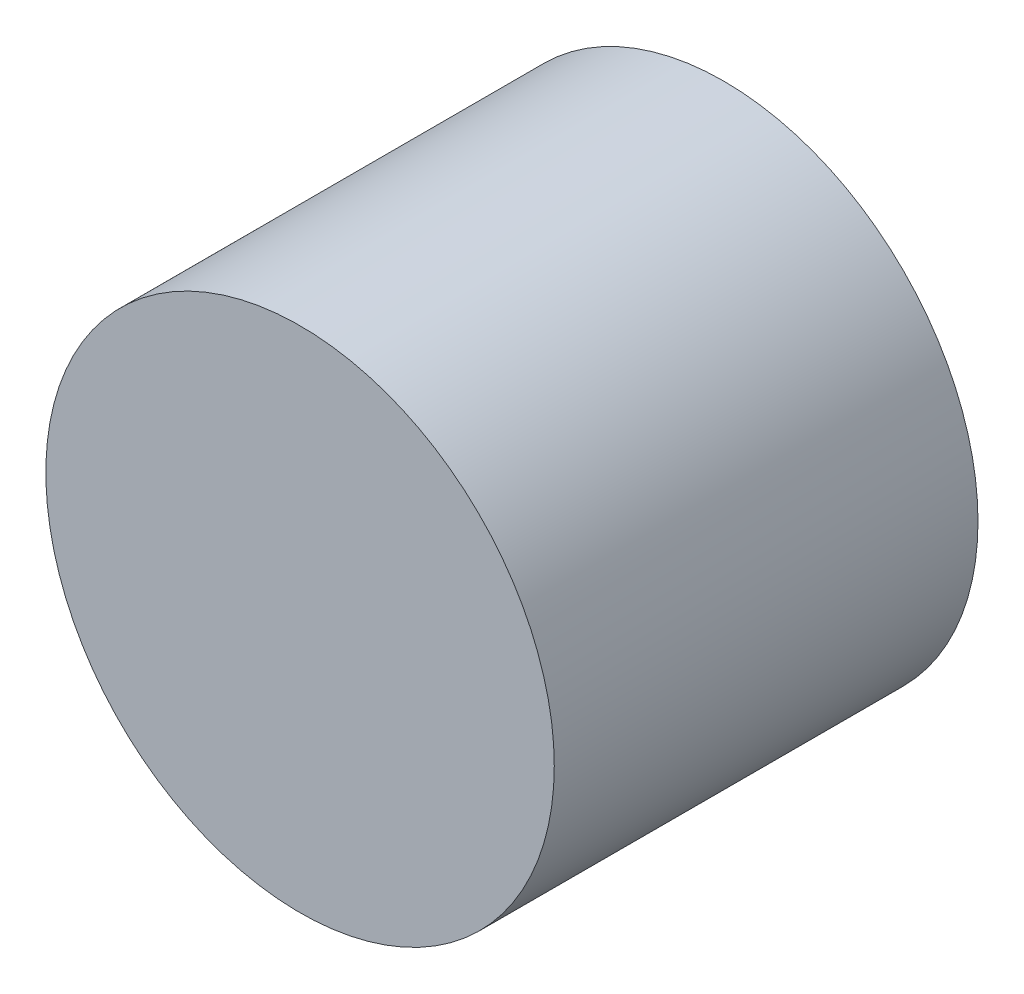
ISO-10303-21;
HEADER;
FILE_DESCRIPTION(('STEP AP214'),'2;1');
FILE_NAME('part.step','',(''),(''),'','','');
FILE_SCHEMA(('AUTOMOTIVE_DESIGN { 1 0 10303 214 1 1 1 1 }'));
ENDSEC;
DATA;
#1=APPLICATION_CONTEXT('core data for automotive mechanical design processes');
#2=APPLICATION_PROTOCOL_DEFINITION('international standard','automotive_design',2000,#1);
#3=PRODUCT_CONTEXT('',#1,'mechanical');
#4=PRODUCT('Part','Part','',(#3));
#5=PRODUCT_RELATED_PRODUCT_CATEGORY('part','',(#4));
#6=PRODUCT_DEFINITION_FORMATION('','',#4);
#7=PRODUCT_DEFINITION_CONTEXT('part definition',#1,'design');
#8=PRODUCT_DEFINITION('design','',#6,#7);
#9=PRODUCT_DEFINITION_SHAPE('','',#8);
#10=(LENGTH_UNIT() NAMED_UNIT(*) SI_UNIT(.MILLI.,.METRE.));
#11=(NAMED_UNIT(*) PLANE_ANGLE_UNIT() SI_UNIT($,.RADIAN.));
#12=(NAMED_UNIT(*) SI_UNIT($,.STERADIAN.) SOLID_ANGLE_UNIT());
#13=UNCERTAINTY_MEASURE_WITH_UNIT(LENGTH_MEASURE(1.E-05),#10,'distance_accuracy_value','');
#14=(GEOMETRIC_REPRESENTATION_CONTEXT(3) GLOBAL_UNCERTAINTY_ASSIGNED_CONTEXT((#13)) GLOBAL_UNIT_ASSIGNED_CONTEXT((#10,
#11,#12)) REPRESENTATION_CONTEXT('',''));
#15=CARTESIAN_POINT('',(0.,0.,0.));
#16=DIRECTION('',(0.,0.,1.));
#17=DIRECTION('',(1.,0.,0.));
#18=AXIS2_PLACEMENT_3D('',#15,#16,#17);
#19=CARTESIAN_POINT('',(0.,70.,-10.));
#20=DIRECTION('',(0.,0.,-1.));
#21=DIRECTION('',(-1.,0.,0.));
#22=AXIS2_PLACEMENT_3D('',#19,#20,#21);
#23=PLANE('',#22);
#24=CARTESIAN_POINT('',(15.,52.5,-10.));
#25=DIRECTION('',(0.,0.,-1.));
#26=DIRECTION('',(-1.,0.,0.));
#27=AXIS2_PLACEMENT_3D('',#24,#25,#26);
#28=CIRCLE('',#27,6.);
#29=CARTESIAN_POINT('',(9.,52.5,-10.));
#30=VERTEX_POINT('',#29);
#31=EDGE_CURVE('E10',#30,#30,#28,.F.);
#32=ORIENTED_EDGE('',*,*,#31,.F.);
#33=EDGE_LOOP('',(#32));
#34=FACE_BOUND('',#33,.T.);
#35=ADVANCED_FACE('F37',(#34),#23,.T.);
#36=CARTESIAN_POINT('',(15.,52.5,0.));
#37=DIRECTION('',(0.,0.,1.));
#38=DIRECTION('',(1.,0.,0.));
#39=AXIS2_PLACEMENT_3D('',#36,#37,#38);
#40=PLANE('',#39);
#41=CARTESIAN_POINT('',(15.,52.5,0.));
#42=DIRECTION('',(0.,0.,1.));
#43=DIRECTION('',(1.,0.,0.));
#44=AXIS2_PLACEMENT_3D('',#41,#42,#43);
#45=CIRCLE('',#44,6.);
#46=CARTESIAN_POINT('',(21.,52.5,0.));
#47=VERTEX_POINT('',#46);
#48=EDGE_CURVE('E44',#47,#47,#45,.T.);
#49=ORIENTED_EDGE('',*,*,#48,.T.);
#50=EDGE_LOOP('',(#49));
#51=FACE_BOUND('',#50,.T.);
#52=ADVANCED_FACE('F56',(#51),#40,.T.);
#53=CARTESIAN_POINT('',(15.,52.5,-36.9705627484771));
#54=DIRECTION('',(0.,0.,1.));
#55=DIRECTION('',(1.,0.,0.));
#56=AXIS2_PLACEMENT_3D('',#53,#54,#55);
#57=CYLINDRICAL_SURFACE('',#56,6.);
#58=ORIENTED_EDGE('',*,*,#48,.F.);
#59=EDGE_LOOP('',(#58));
#60=FACE_BOUND('',#59,.T.);
#61=ORIENTED_EDGE('',*,*,#31,.T.);
#62=EDGE_LOOP('',(#61));
#63=FACE_BOUND('',#62,.T.);
#64=ADVANCED_FACE('F58',(#60,#63),#57,.T.);
#65=CLOSED_SHELL('',(#35,#52,#64));
#66=MANIFOLD_SOLID_BREP('B2',#65);
#67=ADVANCED_BREP_SHAPE_REPRESENTATION('',(#18,#66),#14);
#68=SHAPE_DEFINITION_REPRESENTATION(#9,#67);
ENDSEC;
END-ISO-10303-21;
